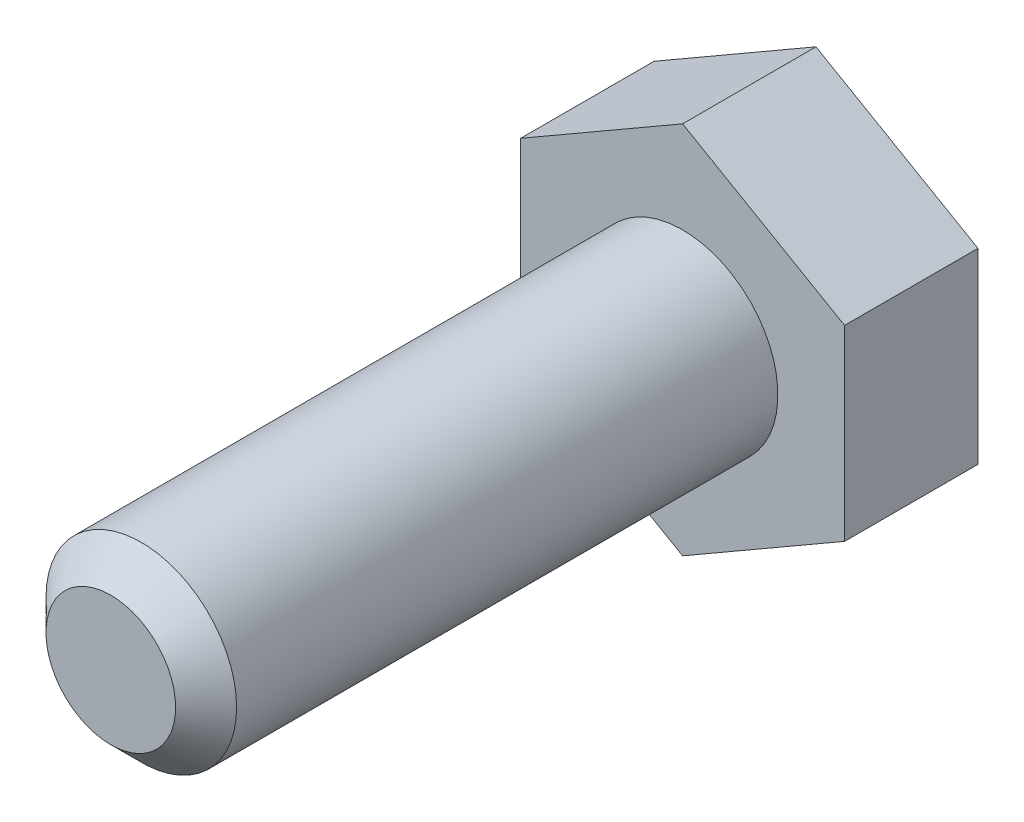
ISO-10303-21;
HEADER;
FILE_DESCRIPTION(('STEP AP214'),'2;1');
FILE_NAME('part.step','',(''),(''),'','','');
FILE_SCHEMA(('AUTOMOTIVE_DESIGN { 1 0 10303 214 1 1 1 1 }'));
ENDSEC;
DATA;
#1=APPLICATION_CONTEXT('core data for automotive mechanical design processes');
#2=APPLICATION_PROTOCOL_DEFINITION('international standard','automotive_design',2000,#1);
#3=PRODUCT_CONTEXT('',#1,'mechanical');
#4=PRODUCT('Part','Part','',(#3));
#5=PRODUCT_RELATED_PRODUCT_CATEGORY('part','',(#4));
#6=PRODUCT_DEFINITION_FORMATION('','',#4);
#7=PRODUCT_DEFINITION_CONTEXT('part definition',#1,'design');
#8=PRODUCT_DEFINITION('design','',#6,#7);
#9=PRODUCT_DEFINITION_SHAPE('','',#8);
#10=(LENGTH_UNIT() NAMED_UNIT(*) SI_UNIT(.MILLI.,.METRE.));
#11=(NAMED_UNIT(*) PLANE_ANGLE_UNIT() SI_UNIT($,.RADIAN.));
#12=(NAMED_UNIT(*) SI_UNIT($,.STERADIAN.) SOLID_ANGLE_UNIT());
#13=UNCERTAINTY_MEASURE_WITH_UNIT(LENGTH_MEASURE(1.E-05),#10,'distance_accuracy_value','');
#14=(GEOMETRIC_REPRESENTATION_CONTEXT(3) GLOBAL_UNCERTAINTY_ASSIGNED_CONTEXT((#13)) GLOBAL_UNIT_ASSIGNED_CONTEXT((#10,
#11,#12)) REPRESENTATION_CONTEXT('',''));
#15=CARTESIAN_POINT('',(0.,0.,0.));
#16=DIRECTION('',(0.,0.,1.));
#17=DIRECTION('',(1.,0.,0.));
#18=AXIS2_PLACEMENT_3D('',#15,#16,#17);
#19=CARTESIAN_POINT('',(0.,0.,30.));
#20=DIRECTION('',(0.,0.,-1.));
#21=DIRECTION('',(-1.,0.,0.));
#22=AXIS2_PLACEMENT_3D('',#19,#20,#21);
#23=CYLINDRICAL_SURFACE('',#22,5.);
#24=CARTESIAN_POINT('',(0.,0.,28.4));
#25=DIRECTION('',(0.,0.,1.));
#26=DIRECTION('',(1.,0.,0.));
#27=AXIS2_PLACEMENT_3D('',#24,#25,#26);
#28=CIRCLE('',#27,5.);
#29=CARTESIAN_POINT('',(5.,0.,28.4));
#30=VERTEX_POINT('',#29);
#31=EDGE_CURVE('E11',#30,#30,#28,.F.);
#32=ORIENTED_EDGE('',*,*,#31,.T.);
#33=EDGE_LOOP('',(#32));
#34=FACE_BOUND('',#33,.T.);
#35=CARTESIAN_POINT('',(0.,0.,0.));
#36=DIRECTION('',(0.,0.,-1.));
#37=DIRECTION('',(-1.,0.,0.));
#38=AXIS2_PLACEMENT_3D('',#35,#36,#37);
#39=CIRCLE('',#38,5.);
#40=CARTESIAN_POINT('',(-5.,0.,0.));
#41=VERTEX_POINT('',#40);
#42=EDGE_CURVE('E147',#41,#41,#39,.T.);
#43=ORIENTED_EDGE('',*,*,#42,.F.);
#44=EDGE_LOOP('',(#43));
#45=FACE_BOUND('',#44,.T.);
#46=ADVANCED_FACE('F42',(#34,#45),#23,.T.);
#47=CARTESIAN_POINT('',(0.,0.,30.));
#48=DIRECTION('',(0.,0.,1.));
#49=DIRECTION('',(1.,0.,0.));
#50=AXIS2_PLACEMENT_3D('',#47,#48,#49);
#51=PLANE('',#50);
#52=CARTESIAN_POINT('',(0.,0.,30.));
#53=DIRECTION('',(0.,0.,1.));
#54=DIRECTION('',(1.,0.,0.));
#55=AXIS2_PLACEMENT_3D('',#52,#53,#54);
#56=CIRCLE('',#55,3.4);
#57=CARTESIAN_POINT('',(3.4,0.,30.));
#58=VERTEX_POINT('',#57);
#59=EDGE_CURVE('E51',#58,#58,#56,.T.);
#60=ORIENTED_EDGE('',*,*,#59,.T.);
#61=EDGE_LOOP('',(#60));
#62=FACE_BOUND('',#61,.T.);
#63=ADVANCED_FACE('F152',(#62),#51,.T.);
#64=CARTESIAN_POINT('',(-8.49999999999999,4.90747728811182,-7.));
#65=DIRECTION('',(0.5,-0.866025403784439,0.));
#66=DIRECTION('',(0.866025403784439,0.5,0.));
#67=AXIS2_PLACEMENT_3D('',#64,#65,#66);
#68=PLANE('',#67);
#69=DIRECTION('',(0.866025403784439,0.5,0.));
#70=VECTOR('',#69,1.);
#71=CARTESIAN_POINT('',(-8.49999999999999,4.90747728811182,0.));
#72=LINE('',#71,#70);
#73=CARTESIAN_POINT('',(-8.49999999999999,4.90747728811182,0.));
#74=VERTEX_POINT('',#73);
#75=CARTESIAN_POINT('',(0.,9.81495457622364,0.));
#76=VERTEX_POINT('',#75);
#77=EDGE_CURVE('E128',#74,#76,#72,.T.);
#78=ORIENTED_EDGE('',*,*,#77,.T.);
#79=DIRECTION('',(0.,0.,1.));
#80=VECTOR('',#79,1.);
#81=CARTESIAN_POINT('',(0.,9.81495457622364,-7.));
#82=LINE('',#81,#80);
#83=CARTESIAN_POINT('',(0.,9.81495457622364,-7.));
#84=VERTEX_POINT('',#83);
#85=EDGE_CURVE('E145',#84,#76,#82,.T.);
#86=ORIENTED_EDGE('',*,*,#85,.F.);
#87=DIRECTION('',(0.866025403784439,0.5,0.));
#88=VECTOR('',#87,1.);
#89=CARTESIAN_POINT('',(-8.49999999999999,4.90747728811182,-7.));
#90=LINE('',#89,#88);
#91=CARTESIAN_POINT('',(-8.49999999999999,4.90747728811182,-7.));
#92=VERTEX_POINT('',#91);
#93=EDGE_CURVE('E138',#92,#84,#90,.T.);
#94=ORIENTED_EDGE('',*,*,#93,.F.);
#95=DIRECTION('',(0.,0.,1.));
#96=VECTOR('',#95,1.);
#97=CARTESIAN_POINT('',(-8.49999999999999,4.90747728811182,-7.));
#98=LINE('',#97,#96);
#99=EDGE_CURVE('E124',#92,#74,#98,.T.);
#100=ORIENTED_EDGE('',*,*,#99,.T.);
#101=EDGE_LOOP('',(#78,#86,#94,#100));
#102=FACE_BOUND('',#101,.T.);
#103=ADVANCED_FACE('F168',(#102),#68,.F.);
#104=CARTESIAN_POINT('',(0.,9.81495457622364,-7.));
#105=DIRECTION('',(-0.5,-0.866025403784439,0.));
#106=DIRECTION('',(0.866025403784439,-0.5,0.));
#107=AXIS2_PLACEMENT_3D('',#104,#105,#106);
#108=PLANE('',#107);
#109=DIRECTION('',(0.866025403784439,-0.5,0.));
#110=VECTOR('',#109,1.);
#111=CARTESIAN_POINT('',(0.,9.81495457622364,0.));
#112=LINE('',#111,#110);
#113=CARTESIAN_POINT('',(8.5,4.90747728811182,0.));
#114=VERTEX_POINT('',#113);
#115=EDGE_CURVE('E131',#76,#114,#112,.T.);
#116=ORIENTED_EDGE('',*,*,#115,.T.);
#117=DIRECTION('',(0.,0.,1.));
#118=VECTOR('',#117,1.);
#119=CARTESIAN_POINT('',(8.5,4.90747728811182,-7.));
#120=LINE('',#119,#118);
#121=CARTESIAN_POINT('',(8.5,4.90747728811182,-7.));
#122=VERTEX_POINT('',#121);
#123=EDGE_CURVE('E142',#122,#114,#120,.T.);
#124=ORIENTED_EDGE('',*,*,#123,.F.);
#125=DIRECTION('',(0.866025403784439,-0.5,0.));
#126=VECTOR('',#125,1.);
#127=CARTESIAN_POINT('',(0.,9.81495457622364,-7.));
#128=LINE('',#127,#126);
#129=EDGE_CURVE('E97',#84,#122,#128,.T.);
#130=ORIENTED_EDGE('',*,*,#129,.F.);
#131=ORIENTED_EDGE('',*,*,#85,.T.);
#132=EDGE_LOOP('',(#116,#124,#130,#131));
#133=FACE_BOUND('',#132,.T.);
#134=ADVANCED_FACE('F174',(#133),#108,.F.);
#135=CARTESIAN_POINT('',(8.5,4.90747728811182,-7.));
#136=DIRECTION('',(-1.,0.,0.));
#137=DIRECTION('',(0.,-1.,0.));
#138=AXIS2_PLACEMENT_3D('',#135,#136,#137);
#139=PLANE('',#138);
#140=DIRECTION('',(0.,-1.,0.));
#141=VECTOR('',#140,1.);
#142=CARTESIAN_POINT('',(8.5,4.90747728811182,0.));
#143=LINE('',#142,#141);
#144=CARTESIAN_POINT('',(8.5,-4.90747728811182,0.));
#145=VERTEX_POINT('',#144);
#146=EDGE_CURVE('E133',#114,#145,#143,.T.);
#147=ORIENTED_EDGE('',*,*,#146,.T.);
#148=DIRECTION('',(0.,0.,1.));
#149=VECTOR('',#148,1.);
#150=CARTESIAN_POINT('',(8.5,-4.90747728811182,-7.));
#151=LINE('',#150,#149);
#152=CARTESIAN_POINT('',(8.5,-4.90747728811182,-7.));
#153=VERTEX_POINT('',#152);
#154=EDGE_CURVE('E119',#153,#145,#151,.T.);
#155=ORIENTED_EDGE('',*,*,#154,.F.);
#156=DIRECTION('',(0.,-1.,0.));
#157=VECTOR('',#156,1.);
#158=CARTESIAN_POINT('',(8.5,4.90747728811182,-7.));
#159=LINE('',#158,#157);
#160=EDGE_CURVE('E110',#122,#153,#159,.T.);
#161=ORIENTED_EDGE('',*,*,#160,.F.);
#162=ORIENTED_EDGE('',*,*,#123,.T.);
#163=EDGE_LOOP('',(#147,#155,#161,#162));
#164=FACE_BOUND('',#163,.T.);
#165=ADVANCED_FACE('F178',(#164),#139,.F.);
#166=CARTESIAN_POINT('',(8.5,-4.90747728811182,-7.));
#167=DIRECTION('',(-0.5,0.866025403784439,0.));
#168=DIRECTION('',(-0.866025403784439,-0.5,0.));
#169=AXIS2_PLACEMENT_3D('',#166,#167,#168);
#170=PLANE('',#169);
#171=DIRECTION('',(-0.866025403784439,-0.5,0.));
#172=VECTOR('',#171,1.);
#173=CARTESIAN_POINT('',(8.5,-4.90747728811182,0.));
#174=LINE('',#173,#172);
#175=CARTESIAN_POINT('',(0.,-9.81495457622364,0.));
#176=VERTEX_POINT('',#175);
#177=EDGE_CURVE('E118',#145,#176,#174,.T.);
#178=ORIENTED_EDGE('',*,*,#177,.T.);
#179=DIRECTION('',(0.,0.,1.));
#180=VECTOR('',#179,1.);
#181=CARTESIAN_POINT('',(0.,-9.81495457622364,-7.));
#182=LINE('',#181,#180);
#183=CARTESIAN_POINT('',(0.,-9.81495457622364,-7.));
#184=VERTEX_POINT('',#183);
#185=EDGE_CURVE('E115',#184,#176,#182,.T.);
#186=ORIENTED_EDGE('',*,*,#185,.F.);
#187=DIRECTION('',(-0.866025403784439,-0.5,0.));
#188=VECTOR('',#187,1.);
#189=CARTESIAN_POINT('',(8.5,-4.90747728811182,-7.));
#190=LINE('',#189,#188);
#191=EDGE_CURVE('E104',#153,#184,#190,.T.);
#192=ORIENTED_EDGE('',*,*,#191,.F.);
#193=ORIENTED_EDGE('',*,*,#154,.T.);
#194=EDGE_LOOP('',(#178,#186,#192,#193));
#195=FACE_BOUND('',#194,.T.);
#196=ADVANCED_FACE('F116',(#195),#170,.F.);
#197=CARTESIAN_POINT('',(0.,-9.81495457622364,-7.));
#198=DIRECTION('',(0.5,0.866025403784439,0.));
#199=DIRECTION('',(-0.866025403784439,0.5,0.));
#200=AXIS2_PLACEMENT_3D('',#197,#198,#199);
#201=PLANE('',#200);
#202=DIRECTION('',(-0.866025403784439,0.5,0.));
#203=VECTOR('',#202,1.);
#204=CARTESIAN_POINT('',(0.,-9.81495457622364,0.));
#205=LINE('',#204,#203);
#206=CARTESIAN_POINT('',(-8.49999999999999,-4.90747728811183,0.));
#207=VERTEX_POINT('',#206);
#208=EDGE_CURVE('E82',#176,#207,#205,.T.);
#209=ORIENTED_EDGE('',*,*,#208,.T.);
#210=DIRECTION('',(0.,0.,1.));
#211=VECTOR('',#210,1.);
#212=CARTESIAN_POINT('',(-8.49999999999999,-4.90747728811183,-7.));
#213=LINE('',#212,#211);
#214=CARTESIAN_POINT('',(-8.49999999999999,-4.90747728811183,-7.));
#215=VERTEX_POINT('',#214);
#216=EDGE_CURVE('E120',#215,#207,#213,.T.);
#217=ORIENTED_EDGE('',*,*,#216,.F.);
#218=DIRECTION('',(-0.866025403784439,0.5,0.));
#219=VECTOR('',#218,1.);
#220=CARTESIAN_POINT('',(0.,-9.81495457622364,-7.));
#221=LINE('',#220,#219);
#222=EDGE_CURVE('E108',#184,#215,#221,.T.);
#223=ORIENTED_EDGE('',*,*,#222,.F.);
#224=ORIENTED_EDGE('',*,*,#185,.T.);
#225=EDGE_LOOP('',(#209,#217,#223,#224));
#226=FACE_BOUND('',#225,.T.);
#227=ADVANCED_FACE('F122',(#226),#201,.F.);
#228=CARTESIAN_POINT('',(-8.49999999999999,-4.90747728811183,-7.));
#229=DIRECTION('',(1.,0.,0.));
#230=DIRECTION('',(0.,0.,-1.));
#231=AXIS2_PLACEMENT_3D('',#228,#229,#230);
#232=PLANE('',#231);
#233=DIRECTION('',(0.,1.,0.));
#234=VECTOR('',#233,1.);
#235=CARTESIAN_POINT('',(-8.49999999999999,-4.90747728811183,0.));
#236=LINE('',#235,#234);
#237=EDGE_CURVE('E88',#207,#74,#236,.T.);
#238=ORIENTED_EDGE('',*,*,#237,.T.);
#239=ORIENTED_EDGE('',*,*,#99,.F.);
#240=DIRECTION('',(0.,1.,0.));
#241=VECTOR('',#240,1.);
#242=CARTESIAN_POINT('',(-8.49999999999999,-4.90747728811183,-7.));
#243=LINE('',#242,#241);
#244=EDGE_CURVE('E59',#215,#92,#243,.T.);
#245=ORIENTED_EDGE('',*,*,#244,.F.);
#246=ORIENTED_EDGE('',*,*,#216,.T.);
#247=EDGE_LOOP('',(#238,#239,#245,#246));
#248=FACE_BOUND('',#247,.T.);
#249=ADVANCED_FACE('F186',(#248),#232,.F.);
#250=CARTESIAN_POINT('',(8.5,14.7224318643355,-7.));
#251=DIRECTION('',(0.,0.,-1.));
#252=DIRECTION('',(-1.,0.,0.));
#253=AXIS2_PLACEMENT_3D('',#250,#251,#252);
#254=PLANE('',#253);
#255=ORIENTED_EDGE('',*,*,#93,.T.);
#256=ORIENTED_EDGE('',*,*,#129,.T.);
#257=ORIENTED_EDGE('',*,*,#160,.T.);
#258=ORIENTED_EDGE('',*,*,#191,.T.);
#259=ORIENTED_EDGE('',*,*,#222,.T.);
#260=ORIENTED_EDGE('',*,*,#244,.T.);
#261=EDGE_LOOP('',(#255,#256,#257,#258,#259,#260));
#262=FACE_BOUND('',#261,.T.);
#263=ADVANCED_FACE('F106',(#262),#254,.T.);
#264=CARTESIAN_POINT('',(8.5,14.7224318643355,0.));
#265=DIRECTION('',(0.,0.,-1.));
#266=DIRECTION('',(-1.,0.,0.));
#267=AXIS2_PLACEMENT_3D('',#264,#265,#266);
#268=PLANE('',#267);
#269=ORIENTED_EDGE('',*,*,#42,.T.);
#270=EDGE_LOOP('',(#269));
#271=FACE_BOUND('',#270,.T.);
#272=ORIENTED_EDGE('',*,*,#77,.F.);
#273=ORIENTED_EDGE('',*,*,#237,.F.);
#274=ORIENTED_EDGE('',*,*,#208,.F.);
#275=ORIENTED_EDGE('',*,*,#177,.F.);
#276=ORIENTED_EDGE('',*,*,#146,.F.);
#277=ORIENTED_EDGE('',*,*,#115,.F.);
#278=EDGE_LOOP('',(#272,#273,#274,#275,#276,#277));
#279=FACE_BOUND('',#278,.T.);
#280=ADVANCED_FACE('F155',(#271,#279),#268,.F.);
#281=CARTESIAN_POINT('',(0.,0.,30.));
#282=DIRECTION('',(0.,0.,-1.));
#283=DIRECTION('',(-1.,0.,0.));
#284=AXIS2_PLACEMENT_3D('',#281,#282,#283);
#285=CONICAL_SURFACE('',#284,3.4,0.785398163397446);
#286=ORIENTED_EDGE('',*,*,#31,.F.);
#287=EDGE_LOOP('',(#286));
#288=FACE_BOUND('',#287,.T.);
#289=ORIENTED_EDGE('',*,*,#59,.F.);
#290=EDGE_LOOP('',(#289));
#291=FACE_BOUND('',#290,.T.);
#292=ADVANCED_FACE('F44',(#288,#291),#285,.T.);
#293=CLOSED_SHELL('',(#46,#63,#103,#134,#165,#196,#227,#249,#263,#280,#292));
#294=MANIFOLD_SOLID_BREP('B2',#293);
#295=ADVANCED_BREP_SHAPE_REPRESENTATION('',(#18,#294),#14);
#296=SHAPE_DEFINITION_REPRESENTATION(#9,#295);
ENDSEC;
END-ISO-10303-21;
